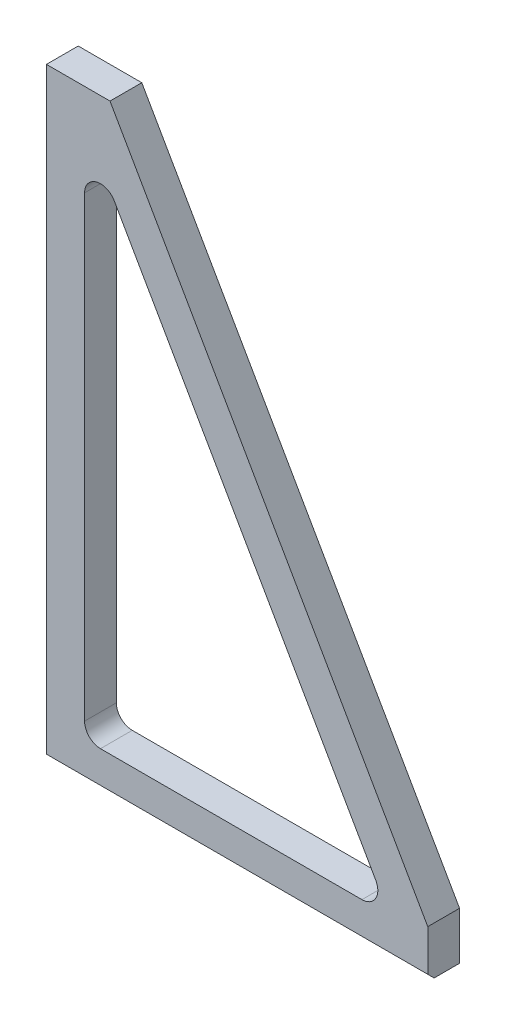
ISO-10303-21;
HEADER;
FILE_DESCRIPTION(('STEP AP214'),'2;1');
FILE_NAME('part.step','',(''),(''),'','','');
FILE_SCHEMA(('AUTOMOTIVE_DESIGN { 1 0 10303 214 1 1 1 1 }'));
ENDSEC;
DATA;
#1=APPLICATION_CONTEXT('core data for automotive mechanical design processes');
#2=APPLICATION_PROTOCOL_DEFINITION('international standard','automotive_design',2000,#1);
#3=PRODUCT_CONTEXT('',#1,'mechanical');
#4=PRODUCT('Part','Part','',(#3));
#5=PRODUCT_RELATED_PRODUCT_CATEGORY('part','',(#4));
#6=PRODUCT_DEFINITION_FORMATION('','',#4);
#7=PRODUCT_DEFINITION_CONTEXT('part definition',#1,'design');
#8=PRODUCT_DEFINITION('design','',#6,#7);
#9=PRODUCT_DEFINITION_SHAPE('','',#8);
#10=(LENGTH_UNIT() NAMED_UNIT(*) SI_UNIT(.MILLI.,.METRE.));
#11=(NAMED_UNIT(*) PLANE_ANGLE_UNIT() SI_UNIT($,.RADIAN.));
#12=(NAMED_UNIT(*) SI_UNIT($,.STERADIAN.) SOLID_ANGLE_UNIT());
#13=UNCERTAINTY_MEASURE_WITH_UNIT(LENGTH_MEASURE(1.E-05),#10,'distance_accuracy_value','');
#14=(GEOMETRIC_REPRESENTATION_CONTEXT(3) GLOBAL_UNCERTAINTY_ASSIGNED_CONTEXT((#13)) GLOBAL_UNIT_ASSIGNED_CONTEXT((#10,
#11,#12)) REPRESENTATION_CONTEXT('',''));
#15=CARTESIAN_POINT('',(0.,0.,0.));
#16=DIRECTION('',(0.,0.,1.));
#17=DIRECTION('',(1.,0.,0.));
#18=AXIS2_PLACEMENT_3D('',#15,#16,#17);
#19=CARTESIAN_POINT('',(0.,241.3,12.7));
#20=DIRECTION('',(0.,0.,-1.));
#21=DIRECTION('',(-1.,0.,0.));
#22=AXIS2_PLACEMENT_3D('',#19,#20,#21);
#23=PLANE('',#22);
#24=DIRECTION('',(0.,-1.,0.));
#25=VECTOR('',#24,1.);
#26=CARTESIAN_POINT('',(0.,0.,12.7));
#27=LINE('',#26,#25);
#28=CARTESIAN_POINT('',(0.,241.3,12.7));
#29=VERTEX_POINT('',#28);
#30=CARTESIAN_POINT('',(0.,2.54000000000001,12.7));
#31=VERTEX_POINT('',#30);
#32=EDGE_CURVE('E177',#29,#31,#27,.T.);
#33=ORIENTED_EDGE('',*,*,#32,.T.);
#34=DIRECTION('',(1.,0.,0.));
#35=VECTOR('',#34,1.);
#36=CARTESIAN_POINT('',(0.,2.54000000000001,12.7));
#37=LINE('',#36,#35);
#38=CARTESIAN_POINT('',(152.4,2.54000000000001,12.7));
#39=VERTEX_POINT('',#38);
#40=EDGE_CURVE('E210',#31,#39,#37,.T.);
#41=ORIENTED_EDGE('',*,*,#40,.T.);
#42=DIRECTION('',(0.,1.,0.));
#43=VECTOR('',#42,1.);
#44=CARTESIAN_POINT('',(152.4,0.,12.7));
#45=LINE('',#44,#43);
#46=CARTESIAN_POINT('',(152.4,19.05,12.7));
#47=VERTEX_POINT('',#46);
#48=EDGE_CURVE('E180',#39,#47,#45,.T.);
#49=ORIENTED_EDGE('',*,*,#48,.T.);
#50=DIRECTION('',(-0.496138938356834,0.868243142124459,0.));
#51=VECTOR('',#50,1.);
#52=CARTESIAN_POINT('',(25.4,241.3,12.7));
#53=LINE('',#52,#51);
#54=CARTESIAN_POINT('',(25.4,241.3,12.7));
#55=VERTEX_POINT('',#54);
#56=EDGE_CURVE('E183',#47,#55,#53,.T.);
#57=ORIENTED_EDGE('',*,*,#56,.T.);
#58=DIRECTION('',(-1.,0.,0.));
#59=VECTOR('',#58,1.);
#60=CARTESIAN_POINT('',(0.,241.3,12.7));
#61=LINE('',#60,#59);
#62=EDGE_CURVE('E185',#55,#29,#61,.T.);
#63=ORIENTED_EDGE('',*,*,#62,.T.);
#64=EDGE_LOOP('',(#33,#41,#49,#57,#63));
#65=FACE_BOUND('',#64,.T.);
#66=CARTESIAN_POINT('',(126.082265030605,21.59,12.7));
#67=DIRECTION('',(0.,0.,1.));
#68=DIRECTION('',(-1.,0.,0.));
#69=AXIS2_PLACEMENT_3D('',#66,#67,#68);
#70=CIRCLE('',#69,6.35);
#71=CARTESIAN_POINT('',(126.082265030605,15.24,12.7));
#72=VERTEX_POINT('',#71);
#73=CARTESIAN_POINT('',(131.595608983095,24.7404822585659,12.7));
#74=VERTEX_POINT('',#73);
#75=EDGE_CURVE('E121',#72,#74,#70,.T.);
#76=ORIENTED_EDGE('',*,*,#75,.F.);
#77=DIRECTION('',(1.,0.,0.));
#78=VECTOR('',#77,1.);
#79=CARTESIAN_POINT('',(21.59,15.24,12.7));
#80=LINE('',#79,#78);
#81=CARTESIAN_POINT('',(21.59,15.24,12.7));
#82=VERTEX_POINT('',#81);
#83=EDGE_CURVE('E153',#82,#72,#80,.T.);
#84=ORIENTED_EDGE('',*,*,#83,.F.);
#85=CARTESIAN_POINT('',(21.59,21.59,12.7));
#86=DIRECTION('',(0.,0.,1.));
#87=DIRECTION('',(1.,0.,0.));
#88=AXIS2_PLACEMENT_3D('',#85,#86,#87);
#89=CIRCLE('',#88,6.35);
#90=CARTESIAN_POINT('',(15.24,21.59,12.7));
#91=VERTEX_POINT('',#90);
#92=EDGE_CURVE('E150',#91,#82,#89,.T.);
#93=ORIENTED_EDGE('',*,*,#92,.F.);
#94=DIRECTION('',(0.,-1.,0.));
#95=VECTOR('',#94,1.);
#96=CARTESIAN_POINT('',(15.24,21.59,12.7));
#97=LINE('',#96,#95);
#98=CARTESIAN_POINT('',(15.24,204.451463803559,12.7));
#99=VERTEX_POINT('',#98);
#100=EDGE_CURVE('E146',#99,#91,#97,.T.);
#101=ORIENTED_EDGE('',*,*,#100,.F.);
#102=CARTESIAN_POINT('',(21.59,204.451463803559,12.7));
#103=DIRECTION('',(0.,0.,1.));
#104=DIRECTION('',(-1.,0.,0.));
#105=AXIS2_PLACEMENT_3D('',#102,#103,#104);
#106=CIRCLE('',#105,6.35000000000001);
#107=CARTESIAN_POINT('',(27.1033439524903,207.601946062124,12.7));
#108=VERTEX_POINT('',#107);
#109=EDGE_CURVE('E144',#108,#99,#106,.T.);
#110=ORIENTED_EDGE('',*,*,#109,.F.);
#111=DIRECTION('',(-0.496138938356834,0.868243142124459,0.));
#112=VECTOR('',#111,1.);
#113=CARTESIAN_POINT('',(27.1033439524903,207.601946062124,12.7));
#114=LINE('',#113,#112);
#115=EDGE_CURVE('E131',#74,#108,#114,.T.);
#116=ORIENTED_EDGE('',*,*,#115,.F.);
#117=EDGE_LOOP('',(#76,#84,#93,#101,#110,#116));
#118=FACE_BOUND('',#117,.T.);
#119=ADVANCED_FACE('F33',(#65,#118),#23,.F.);
#120=CARTESIAN_POINT('',(0.,241.3,0.));
#121=DIRECTION('',(0.,0.,-1.));
#122=DIRECTION('',(-1.,0.,0.));
#123=AXIS2_PLACEMENT_3D('',#120,#121,#122);
#124=PLANE('',#123);
#125=DIRECTION('',(0.,-1.,0.));
#126=VECTOR('',#125,1.);
#127=CARTESIAN_POINT('',(0.,0.,0.));
#128=LINE('',#127,#126);
#129=CARTESIAN_POINT('',(0.,241.3,0.));
#130=VERTEX_POINT('',#129);
#131=CARTESIAN_POINT('',(0.,0.,0.));
#132=VERTEX_POINT('',#131);
#133=EDGE_CURVE('E139',#130,#132,#128,.T.);
#134=ORIENTED_EDGE('',*,*,#133,.F.);
#135=DIRECTION('',(-1.,0.,0.));
#136=VECTOR('',#135,1.);
#137=CARTESIAN_POINT('',(0.,241.3,0.));
#138=LINE('',#137,#136);
#139=CARTESIAN_POINT('',(25.4,241.3,0.));
#140=VERTEX_POINT('',#139);
#141=EDGE_CURVE('E181',#140,#130,#138,.T.);
#142=ORIENTED_EDGE('',*,*,#141,.F.);
#143=DIRECTION('',(-0.496138938356834,0.868243142124459,0.));
#144=VECTOR('',#143,1.);
#145=CARTESIAN_POINT('',(25.4,241.3,0.));
#146=LINE('',#145,#144);
#147=CARTESIAN_POINT('',(152.4,19.05,0.));
#148=VERTEX_POINT('',#147);
#149=EDGE_CURVE('E195',#148,#140,#146,.T.);
#150=ORIENTED_EDGE('',*,*,#149,.F.);
#151=DIRECTION('',(0.,1.,0.));
#152=VECTOR('',#151,1.);
#153=CARTESIAN_POINT('',(152.4,0.,0.));
#154=LINE('',#153,#152);
#155=CARTESIAN_POINT('',(152.4,0.,0.));
#156=VERTEX_POINT('',#155);
#157=EDGE_CURVE('E193',#156,#148,#154,.T.);
#158=ORIENTED_EDGE('',*,*,#157,.F.);
#159=DIRECTION('',(1.,0.,0.));
#160=VECTOR('',#159,1.);
#161=CARTESIAN_POINT('',(0.,0.,0.));
#162=LINE('',#161,#160);
#163=EDGE_CURVE('E190',#132,#156,#162,.T.);
#164=ORIENTED_EDGE('',*,*,#163,.F.);
#165=EDGE_LOOP('',(#134,#142,#150,#158,#164));
#166=FACE_BOUND('',#165,.T.);
#167=DIRECTION('',(1.,0.,0.));
#168=VECTOR('',#167,1.);
#169=CARTESIAN_POINT('',(21.59,15.24,0.));
#170=LINE('',#169,#168);
#171=CARTESIAN_POINT('',(21.59,15.24,0.));
#172=VERTEX_POINT('',#171);
#173=CARTESIAN_POINT('',(126.082265030605,15.24,0.));
#174=VERTEX_POINT('',#173);
#175=EDGE_CURVE('E132',#172,#174,#170,.T.);
#176=ORIENTED_EDGE('',*,*,#175,.T.);
#177=CARTESIAN_POINT('',(126.082265030605,21.59,0.));
#178=DIRECTION('',(0.,0.,1.));
#179=DIRECTION('',(-1.,0.,0.));
#180=AXIS2_PLACEMENT_3D('',#177,#178,#179);
#181=CIRCLE('',#180,6.35);
#182=CARTESIAN_POINT('',(131.595608983095,24.7404822585659,0.));
#183=VERTEX_POINT('',#182);
#184=EDGE_CURVE('E155',#174,#183,#181,.T.);
#185=ORIENTED_EDGE('',*,*,#184,.T.);
#186=DIRECTION('',(-0.496138938356834,0.868243142124459,0.));
#187=VECTOR('',#186,1.);
#188=CARTESIAN_POINT('',(27.1033439524903,207.601946062124,0.));
#189=LINE('',#188,#187);
#190=CARTESIAN_POINT('',(27.1033439524903,207.601946062124,0.));
#191=VERTEX_POINT('',#190);
#192=EDGE_CURVE('E138',#183,#191,#189,.T.);
#193=ORIENTED_EDGE('',*,*,#192,.T.);
#194=CARTESIAN_POINT('',(21.59,204.451463803559,0.));
#195=DIRECTION('',(0.,0.,1.));
#196=DIRECTION('',(-1.,0.,0.));
#197=AXIS2_PLACEMENT_3D('',#194,#195,#196);
#198=CIRCLE('',#197,6.35000000000001);
#199=CARTESIAN_POINT('',(15.24,204.451463803559,0.));
#200=VERTEX_POINT('',#199);
#201=EDGE_CURVE('E158',#191,#200,#198,.T.);
#202=ORIENTED_EDGE('',*,*,#201,.T.);
#203=DIRECTION('',(0.,-1.,0.));
#204=VECTOR('',#203,1.);
#205=CARTESIAN_POINT('',(15.24,21.59,0.));
#206=LINE('',#205,#204);
#207=CARTESIAN_POINT('',(15.24,21.59,0.));
#208=VERTEX_POINT('',#207);
#209=EDGE_CURVE('E161',#200,#208,#206,.T.);
#210=ORIENTED_EDGE('',*,*,#209,.T.);
#211=CARTESIAN_POINT('',(21.59,21.59,0.));
#212=DIRECTION('',(0.,0.,1.));
#213=DIRECTION('',(1.,0.,0.));
#214=AXIS2_PLACEMENT_3D('',#211,#212,#213);
#215=CIRCLE('',#214,6.35);
#216=EDGE_CURVE('E164',#208,#172,#215,.T.);
#217=ORIENTED_EDGE('',*,*,#216,.T.);
#218=EDGE_LOOP('',(#176,#185,#193,#202,#210,#217));
#219=FACE_BOUND('',#218,.T.);
#220=ADVANCED_FACE('F243',(#166,#219),#124,.T.);
#221=CARTESIAN_POINT('',(0.,0.,12.7));
#222=DIRECTION('',(1.,0.,0.));
#223=DIRECTION('',(0.,0.,-1.));
#224=AXIS2_PLACEMENT_3D('',#221,#222,#223);
#225=PLANE('',#224);
#226=DIRECTION('',(0.,0.,-1.));
#227=VECTOR('',#226,1.);
#228=CARTESIAN_POINT('',(0.,0.,12.7));
#229=LINE('',#228,#227);
#230=CARTESIAN_POINT('',(0.,0.,10.16));
#231=VERTEX_POINT('',#230);
#232=EDGE_CURVE('E208',#231,#132,#229,.T.);
#233=ORIENTED_EDGE('',*,*,#232,.F.);
#234=DIRECTION('',(0.,-0.707106781186548,-0.707106781186547));
#235=VECTOR('',#234,1.);
#236=CARTESIAN_POINT('',(0.,2.54000000000001,12.7));
#237=LINE('',#236,#235);
#238=EDGE_CURVE('E11',#231,#31,#237,.F.);
#239=ORIENTED_EDGE('',*,*,#238,.T.);
#240=ORIENTED_EDGE('',*,*,#32,.F.);
#241=DIRECTION('',(0.,0.,-1.));
#242=VECTOR('',#241,1.);
#243=CARTESIAN_POINT('',(0.,241.3,12.7));
#244=LINE('',#243,#242);
#245=EDGE_CURVE('E187',#29,#130,#244,.T.);
#246=ORIENTED_EDGE('',*,*,#245,.T.);
#247=ORIENTED_EDGE('',*,*,#133,.T.);
#248=EDGE_LOOP('',(#233,#239,#240,#246,#247));
#249=FACE_BOUND('',#248,.T.);
#250=ADVANCED_FACE('F233',(#249),#225,.F.);
#251=CARTESIAN_POINT('',(0.,0.,12.7));
#252=DIRECTION('',(0.,1.,0.));
#253=DIRECTION('',(0.,0.,1.));
#254=AXIS2_PLACEMENT_3D('',#251,#252,#253);
#255=PLANE('',#254);
#256=DIRECTION('',(0.,0.,-1.));
#257=VECTOR('',#256,1.);
#258=CARTESIAN_POINT('',(152.4,0.,12.7));
#259=LINE('',#258,#257);
#260=CARTESIAN_POINT('',(152.4,0.,10.16));
#261=VERTEX_POINT('',#260);
#262=EDGE_CURVE('E206',#261,#156,#259,.T.);
#263=ORIENTED_EDGE('',*,*,#262,.F.);
#264=DIRECTION('',(-1.,0.,0.));
#265=VECTOR('',#264,1.);
#266=CARTESIAN_POINT('',(0.,0.,10.16));
#267=LINE('',#266,#265);
#268=EDGE_CURVE('E41',#261,#231,#267,.T.);
#269=ORIENTED_EDGE('',*,*,#268,.T.);
#270=ORIENTED_EDGE('',*,*,#232,.T.);
#271=ORIENTED_EDGE('',*,*,#163,.T.);
#272=EDGE_LOOP('',(#263,#269,#270,#271));
#273=FACE_BOUND('',#272,.T.);
#274=ADVANCED_FACE('F259',(#273),#255,.F.);
#275=CARTESIAN_POINT('',(152.4,0.,12.7));
#276=DIRECTION('',(-1.,0.,0.));
#277=DIRECTION('',(0.,0.,1.));
#278=AXIS2_PLACEMENT_3D('',#275,#276,#277);
#279=PLANE('',#278);
#280=ORIENTED_EDGE('',*,*,#48,.F.);
#281=DIRECTION('',(0.,0.707106781186548,0.707106781186547));
#282=VECTOR('',#281,1.);
#283=CARTESIAN_POINT('',(152.4,2.54000000000001,12.7));
#284=LINE('',#283,#282);
#285=EDGE_CURVE('E55',#39,#261,#284,.F.);
#286=ORIENTED_EDGE('',*,*,#285,.T.);
#287=ORIENTED_EDGE('',*,*,#262,.T.);
#288=ORIENTED_EDGE('',*,*,#157,.T.);
#289=DIRECTION('',(0.,0.,-1.));
#290=VECTOR('',#289,1.);
#291=CARTESIAN_POINT('',(152.4,19.05,12.7));
#292=LINE('',#291,#290);
#293=EDGE_CURVE('E203',#47,#148,#292,.T.);
#294=ORIENTED_EDGE('',*,*,#293,.F.);
#295=EDGE_LOOP('',(#280,#286,#287,#288,#294));
#296=FACE_BOUND('',#295,.T.);
#297=ADVANCED_FACE('F219',(#296),#279,.F.);
#298=CARTESIAN_POINT('',(25.4,241.3,12.7));
#299=DIRECTION('',(-0.868243142124459,-0.496138938356834,0.));
#300=DIRECTION('',(0.496138938356834,-0.868243142124459,0.));
#301=AXIS2_PLACEMENT_3D('',#298,#299,#300);
#302=PLANE('',#301);
#303=ORIENTED_EDGE('',*,*,#149,.T.);
#304=DIRECTION('',(0.,0.,-1.));
#305=VECTOR('',#304,1.);
#306=CARTESIAN_POINT('',(25.4,241.3,12.7));
#307=LINE('',#306,#305);
#308=EDGE_CURVE('E200',#55,#140,#307,.T.);
#309=ORIENTED_EDGE('',*,*,#308,.F.);
#310=ORIENTED_EDGE('',*,*,#56,.F.);
#311=ORIENTED_EDGE('',*,*,#293,.T.);
#312=EDGE_LOOP('',(#303,#309,#310,#311));
#313=FACE_BOUND('',#312,.T.);
#314=ADVANCED_FACE('F225',(#313),#302,.F.);
#315=CARTESIAN_POINT('',(0.,241.3,12.7));
#316=DIRECTION('',(0.,-1.,0.));
#317=DIRECTION('',(0.,0.,-1.));
#318=AXIS2_PLACEMENT_3D('',#315,#316,#317);
#319=PLANE('',#318);
#320=ORIENTED_EDGE('',*,*,#141,.T.);
#321=ORIENTED_EDGE('',*,*,#245,.F.);
#322=ORIENTED_EDGE('',*,*,#62,.F.);
#323=ORIENTED_EDGE('',*,*,#308,.T.);
#324=EDGE_LOOP('',(#320,#321,#322,#323));
#325=FACE_BOUND('',#324,.T.);
#326=ADVANCED_FACE('F229',(#325),#319,.F.);
#327=CARTESIAN_POINT('',(126.082265030605,21.59,12.7));
#328=DIRECTION('',(0.,0.,-1.));
#329=DIRECTION('',(-1.,0.,0.));
#330=AXIS2_PLACEMENT_3D('',#327,#328,#329);
#331=CYLINDRICAL_SURFACE('',#330,6.35);
#332=ORIENTED_EDGE('',*,*,#184,.F.);
#333=DIRECTION('',(0.,0.,-1.));
#334=VECTOR('',#333,1.);
#335=CARTESIAN_POINT('',(126.082265030605,15.24,12.7));
#336=LINE('',#335,#334);
#337=EDGE_CURVE('E127',#72,#174,#336,.T.);
#338=ORIENTED_EDGE('',*,*,#337,.F.);
#339=ORIENTED_EDGE('',*,*,#75,.T.);
#340=DIRECTION('',(0.,0.,-1.));
#341=VECTOR('',#340,1.);
#342=CARTESIAN_POINT('',(131.595608983095,24.7404822585659,12.7));
#343=LINE('',#342,#341);
#344=EDGE_CURVE('E124',#74,#183,#343,.T.);
#345=ORIENTED_EDGE('',*,*,#344,.T.);
#346=EDGE_LOOP('',(#332,#338,#339,#345));
#347=FACE_BOUND('',#346,.T.);
#348=ADVANCED_FACE('F123',(#347),#331,.F.);
#349=CARTESIAN_POINT('',(27.1033439524903,207.601946062124,12.7));
#350=DIRECTION('',(-0.868243142124459,-0.496138938356834,0.));
#351=DIRECTION('',(0.496138938356834,-0.868243142124459,0.));
#352=AXIS2_PLACEMENT_3D('',#349,#350,#351);
#353=PLANE('',#352);
#354=ORIENTED_EDGE('',*,*,#192,.F.);
#355=ORIENTED_EDGE('',*,*,#344,.F.);
#356=ORIENTED_EDGE('',*,*,#115,.T.);
#357=DIRECTION('',(0.,0.,-1.));
#358=VECTOR('',#357,1.);
#359=CARTESIAN_POINT('',(27.1033439524903,207.601946062124,12.7));
#360=LINE('',#359,#358);
#361=EDGE_CURVE('E140',#108,#191,#360,.T.);
#362=ORIENTED_EDGE('',*,*,#361,.T.);
#363=EDGE_LOOP('',(#354,#355,#356,#362));
#364=FACE_BOUND('',#363,.T.);
#365=ADVANCED_FACE('F135',(#364),#353,.T.);
#366=CARTESIAN_POINT('',(21.59,204.451463803559,12.7));
#367=DIRECTION('',(0.,0.,-1.));
#368=DIRECTION('',(-1.,0.,0.));
#369=AXIS2_PLACEMENT_3D('',#366,#367,#368);
#370=CYLINDRICAL_SURFACE('',#369,6.35000000000001);
#371=ORIENTED_EDGE('',*,*,#201,.F.);
#372=ORIENTED_EDGE('',*,*,#361,.F.);
#373=ORIENTED_EDGE('',*,*,#109,.T.);
#374=DIRECTION('',(0.,0.,-1.));
#375=VECTOR('',#374,1.);
#376=CARTESIAN_POINT('',(15.24,204.451463803559,12.7));
#377=LINE('',#376,#375);
#378=EDGE_CURVE('E174',#99,#200,#377,.T.);
#379=ORIENTED_EDGE('',*,*,#378,.T.);
#380=EDGE_LOOP('',(#371,#372,#373,#379));
#381=FACE_BOUND('',#380,.T.);
#382=ADVANCED_FACE('F293',(#381),#370,.F.);
#383=CARTESIAN_POINT('',(15.24,21.59,12.7));
#384=DIRECTION('',(1.,0.,0.));
#385=DIRECTION('',(0.,0.,-1.));
#386=AXIS2_PLACEMENT_3D('',#383,#384,#385);
#387=PLANE('',#386);
#388=ORIENTED_EDGE('',*,*,#209,.F.);
#389=ORIENTED_EDGE('',*,*,#378,.F.);
#390=ORIENTED_EDGE('',*,*,#100,.T.);
#391=DIRECTION('',(0.,0.,-1.));
#392=VECTOR('',#391,1.);
#393=CARTESIAN_POINT('',(15.24,21.59,12.7));
#394=LINE('',#393,#392);
#395=EDGE_CURVE('E172',#91,#208,#394,.T.);
#396=ORIENTED_EDGE('',*,*,#395,.T.);
#397=EDGE_LOOP('',(#388,#389,#390,#396));
#398=FACE_BOUND('',#397,.T.);
#399=ADVANCED_FACE('F299',(#398),#387,.T.);
#400=CARTESIAN_POINT('',(21.59,21.59,12.7));
#401=DIRECTION('',(0.,0.,-1.));
#402=DIRECTION('',(-1.,0.,0.));
#403=AXIS2_PLACEMENT_3D('',#400,#401,#402);
#404=CYLINDRICAL_SURFACE('',#403,6.35);
#405=ORIENTED_EDGE('',*,*,#216,.F.);
#406=ORIENTED_EDGE('',*,*,#395,.F.);
#407=ORIENTED_EDGE('',*,*,#92,.T.);
#408=DIRECTION('',(0.,0.,-1.));
#409=VECTOR('',#408,1.);
#410=CARTESIAN_POINT('',(21.59,15.24,12.7));
#411=LINE('',#410,#409);
#412=EDGE_CURVE('E170',#82,#172,#411,.T.);
#413=ORIENTED_EDGE('',*,*,#412,.T.);
#414=EDGE_LOOP('',(#405,#406,#407,#413));
#415=FACE_BOUND('',#414,.T.);
#416=ADVANCED_FACE('F239',(#415),#404,.F.);
#417=CARTESIAN_POINT('',(21.59,15.24,12.7));
#418=DIRECTION('',(0.,1.,0.));
#419=DIRECTION('',(0.,0.,1.));
#420=AXIS2_PLACEMENT_3D('',#417,#418,#419);
#421=PLANE('',#420);
#422=ORIENTED_EDGE('',*,*,#175,.F.);
#423=ORIENTED_EDGE('',*,*,#412,.F.);
#424=ORIENTED_EDGE('',*,*,#83,.T.);
#425=ORIENTED_EDGE('',*,*,#337,.T.);
#426=EDGE_LOOP('',(#422,#423,#424,#425));
#427=FACE_BOUND('',#426,.T.);
#428=ADVANCED_FACE('F235',(#427),#421,.T.);
#429=CARTESIAN_POINT('',(0.,2.54000000000001,12.7));
#430=DIRECTION('',(0.,0.707106781186547,-0.707106781186548));
#431=DIRECTION('',(0.,0.707106781186548,0.707106781186547));
#432=AXIS2_PLACEMENT_3D('',#429,#430,#431);
#433=PLANE('',#432);
#434=ORIENTED_EDGE('',*,*,#238,.F.);
#435=ORIENTED_EDGE('',*,*,#268,.F.);
#436=ORIENTED_EDGE('',*,*,#285,.F.);
#437=ORIENTED_EDGE('',*,*,#40,.F.);
#438=EDGE_LOOP('',(#434,#435,#436,#437));
#439=FACE_BOUND('',#438,.T.);
#440=ADVANCED_FACE('F35',(#439),#433,.F.);
#441=CLOSED_SHELL('',(#119,#220,#250,#274,#297,#314,#326,#348,#365,#382,#399,#416,#428,#440));
#442=MANIFOLD_SOLID_BREP('B2',#441);
#443=ADVANCED_BREP_SHAPE_REPRESENTATION('',(#18,#442),#14);
#444=SHAPE_DEFINITION_REPRESENTATION(#9,#443);
ENDSEC;
END-ISO-10303-21;
